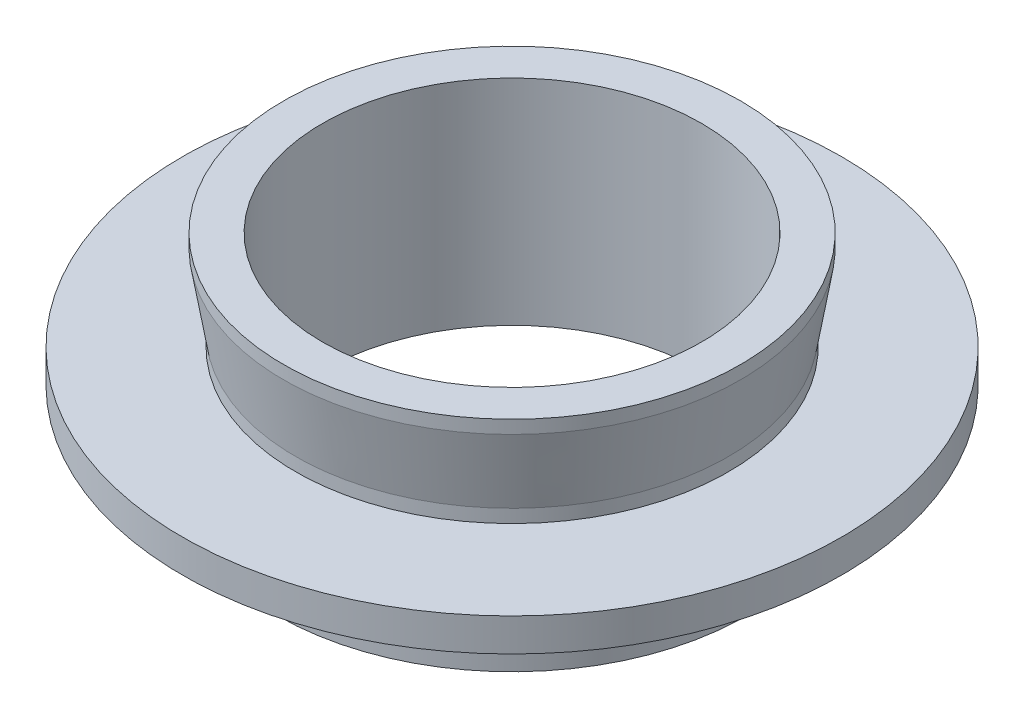
ISO-10303-21;
HEADER;
FILE_DESCRIPTION(('STEP AP214'),'2;1');
FILE_NAME('part.step','',(''),(''),'','','');
FILE_SCHEMA(('AUTOMOTIVE_DESIGN { 1 0 10303 214 1 1 1 1 }'));
ENDSEC;
DATA;
#1=APPLICATION_CONTEXT('core data for automotive mechanical design processes');
#2=APPLICATION_PROTOCOL_DEFINITION('international standard','automotive_design',2000,#1);
#3=PRODUCT_CONTEXT('',#1,'mechanical');
#4=PRODUCT('Part','Part','',(#3));
#5=PRODUCT_RELATED_PRODUCT_CATEGORY('part','',(#4));
#6=PRODUCT_DEFINITION_FORMATION('','',#4);
#7=PRODUCT_DEFINITION_CONTEXT('part definition',#1,'design');
#8=PRODUCT_DEFINITION('design','',#6,#7);
#9=PRODUCT_DEFINITION_SHAPE('','',#8);
#10=(LENGTH_UNIT() NAMED_UNIT(*) SI_UNIT(.MILLI.,.METRE.));
#11=(NAMED_UNIT(*) PLANE_ANGLE_UNIT() SI_UNIT($,.RADIAN.));
#12=(NAMED_UNIT(*) SI_UNIT($,.STERADIAN.) SOLID_ANGLE_UNIT());
#13=UNCERTAINTY_MEASURE_WITH_UNIT(LENGTH_MEASURE(1.E-05),#10,'distance_accuracy_value','');
#14=(GEOMETRIC_REPRESENTATION_CONTEXT(3) GLOBAL_UNCERTAINTY_ASSIGNED_CONTEXT((#13)) GLOBAL_UNIT_ASSIGNED_CONTEXT((#10,
#11,#12)) REPRESENTATION_CONTEXT('',''));
#15=CARTESIAN_POINT('',(0.,0.,0.));
#16=DIRECTION('',(0.,0.,1.));
#17=DIRECTION('',(1.,0.,0.));
#18=AXIS2_PLACEMENT_3D('',#15,#16,#17);
#19=CARTESIAN_POINT('',(-14.25,0.,0.));
#20=DIRECTION('',(0.,1.,0.));
#21=DIRECTION('',(0.,0.,1.));
#22=AXIS2_PLACEMENT_3D('',#19,#20,#21);
#23=PLANE('',#22);
#24=CARTESIAN_POINT('',(0.,0.,0.));
#25=DIRECTION('',(0.,-1.,0.));
#26=DIRECTION('',(0.,0.,-1.));
#27=AXIS2_PLACEMENT_3D('',#24,#25,#26);
#28=CIRCLE('',#27,11.5);
#29=CARTESIAN_POINT('',(0.,0.,-11.5));
#30=VERTEX_POINT('',#29);
#31=EDGE_CURVE('E10',#30,#30,#28,.T.);
#32=ORIENTED_EDGE('',*,*,#31,.F.);
#33=EDGE_LOOP('',(#32));
#34=FACE_BOUND('',#33,.T.);
#35=CARTESIAN_POINT('',(0.,0.,0.));
#36=DIRECTION('',(0.,-1.,0.));
#37=DIRECTION('',(0.,0.,-1.));
#38=AXIS2_PLACEMENT_3D('',#35,#36,#37);
#39=CIRCLE('',#38,14.25);
#40=CARTESIAN_POINT('',(0.,0.,-14.25));
#41=VERTEX_POINT('',#40);
#42=EDGE_CURVE('E77',#41,#41,#39,.T.);
#43=ORIENTED_EDGE('',*,*,#42,.T.);
#44=EDGE_LOOP('',(#43));
#45=FACE_BOUND('',#44,.T.);
#46=ADVANCED_FACE('F37',(#34,#45),#23,.F.);
#47=CARTESIAN_POINT('',(0.,0.,0.));
#48=DIRECTION('',(0.,-1.,0.));
#49=DIRECTION('',(0.,0.,-1.));
#50=AXIS2_PLACEMENT_3D('',#47,#48,#49);
#51=CYLINDRICAL_SURFACE('',#50,11.5);
#52=CARTESIAN_POINT('',(0.,13.,0.));
#53=DIRECTION('',(0.,-1.,0.));
#54=DIRECTION('',(0.,0.,-1.));
#55=AXIS2_PLACEMENT_3D('',#52,#53,#54);
#56=CIRCLE('',#55,11.5);
#57=CARTESIAN_POINT('',(0.,13.,-11.5));
#58=VERTEX_POINT('',#57);
#59=EDGE_CURVE('E43',#58,#58,#56,.T.);
#60=ORIENTED_EDGE('',*,*,#59,.F.);
#61=EDGE_LOOP('',(#60));
#62=FACE_BOUND('',#61,.T.);
#63=ORIENTED_EDGE('',*,*,#31,.T.);
#64=EDGE_LOOP('',(#63));
#65=FACE_BOUND('',#64,.T.);
#66=ADVANCED_FACE('F138',(#62,#65),#51,.F.);
#67=CARTESIAN_POINT('',(-11.5,13.,0.));
#68=DIRECTION('',(0.,-1.,0.));
#69=DIRECTION('',(0.,0.,-1.));
#70=AXIS2_PLACEMENT_3D('',#67,#68,#69);
#71=PLANE('',#70);
#72=CARTESIAN_POINT('',(0.,13.,0.));
#73=DIRECTION('',(0.,-1.,0.));
#74=DIRECTION('',(0.,0.,-1.));
#75=AXIS2_PLACEMENT_3D('',#72,#73,#74);
#76=CIRCLE('',#75,13.865);
#77=CARTESIAN_POINT('',(0.,13.,-13.865));
#78=VERTEX_POINT('',#77);
#79=EDGE_CURVE('E47',#78,#78,#76,.T.);
#80=ORIENTED_EDGE('',*,*,#79,.F.);
#81=EDGE_LOOP('',(#80));
#82=FACE_BOUND('',#81,.T.);
#83=ORIENTED_EDGE('',*,*,#59,.T.);
#84=EDGE_LOOP('',(#83));
#85=FACE_BOUND('',#84,.T.);
#86=ADVANCED_FACE('F133',(#82,#85),#71,.F.);
#87=CARTESIAN_POINT('',(0.,0.,0.));
#88=DIRECTION('',(0.,-1.,0.));
#89=DIRECTION('',(0.,0.,-1.));
#90=AXIS2_PLACEMENT_3D('',#87,#88,#89);
#91=CYLINDRICAL_SURFACE('',#90,13.865);
#92=CARTESIAN_POINT('',(0.,12.2,0.));
#93=DIRECTION('',(0.,-1.,0.));
#94=DIRECTION('',(0.,0.,-1.));
#95=AXIS2_PLACEMENT_3D('',#92,#93,#94);
#96=CIRCLE('',#95,13.865);
#97=CARTESIAN_POINT('',(0.,12.2,-13.865));
#98=VERTEX_POINT('',#97);
#99=EDGE_CURVE('E51',#98,#98,#96,.T.);
#100=ORIENTED_EDGE('',*,*,#99,.F.);
#101=EDGE_LOOP('',(#100));
#102=FACE_BOUND('',#101,.T.);
#103=ORIENTED_EDGE('',*,*,#79,.T.);
#104=EDGE_LOOP('',(#103));
#105=FACE_BOUND('',#104,.T.);
#106=ADVANCED_FACE('F127',(#102,#105),#91,.T.);
#107=CARTESIAN_POINT('',(0.,12.2,0.));
#108=DIRECTION('',(0.,1.,0.));
#109=DIRECTION('',(0.,0.,1.));
#110=AXIS2_PLACEMENT_3D('',#107,#108,#109);
#111=CONICAL_SURFACE('',#110,13.865,0.164411486247026);
#112=CARTESIAN_POINT('',(0.,7.8,0.));
#113=DIRECTION('',(0.,-1.,0.));
#114=DIRECTION('',(0.,0.,-1.));
#115=AXIS2_PLACEMENT_3D('',#112,#113,#114);
#116=CIRCLE('',#115,13.135);
#117=CARTESIAN_POINT('',(0.,7.8,-13.135));
#118=VERTEX_POINT('',#117);
#119=EDGE_CURVE('E56',#118,#118,#116,.T.);
#120=ORIENTED_EDGE('',*,*,#119,.F.);
#121=EDGE_LOOP('',(#120));
#122=FACE_BOUND('',#121,.T.);
#123=ORIENTED_EDGE('',*,*,#99,.T.);
#124=EDGE_LOOP('',(#123));
#125=FACE_BOUND('',#124,.T.);
#126=ADVANCED_FACE('F121',(#122,#125),#111,.T.);
#127=CARTESIAN_POINT('',(0.,0.,0.));
#128=DIRECTION('',(0.,-1.,0.));
#129=DIRECTION('',(0.,0.,-1.));
#130=AXIS2_PLACEMENT_3D('',#127,#128,#129);
#131=CYLINDRICAL_SURFACE('',#130,13.135);
#132=CARTESIAN_POINT('',(0.,7.,0.));
#133=DIRECTION('',(0.,-1.,0.));
#134=DIRECTION('',(0.,0.,-1.));
#135=AXIS2_PLACEMENT_3D('',#132,#133,#134);
#136=CIRCLE('',#135,13.135);
#137=CARTESIAN_POINT('',(0.,7.,-13.135));
#138=VERTEX_POINT('',#137);
#139=EDGE_CURVE('E59',#138,#138,#136,.T.);
#140=ORIENTED_EDGE('',*,*,#139,.F.);
#141=EDGE_LOOP('',(#140));
#142=FACE_BOUND('',#141,.T.);
#143=ORIENTED_EDGE('',*,*,#119,.T.);
#144=EDGE_LOOP('',(#143));
#145=FACE_BOUND('',#144,.T.);
#146=ADVANCED_FACE('F115',(#142,#145),#131,.T.);
#147=CARTESIAN_POINT('',(-13.135,7.,0.));
#148=DIRECTION('',(0.,-1.,0.));
#149=DIRECTION('',(0.,0.,-1.));
#150=AXIS2_PLACEMENT_3D('',#147,#148,#149);
#151=PLANE('',#150);
#152=CARTESIAN_POINT('',(0.,7.,0.));
#153=DIRECTION('',(0.,-1.,0.));
#154=DIRECTION('',(0.,0.,-1.));
#155=AXIS2_PLACEMENT_3D('',#152,#153,#154);
#156=CIRCLE('',#155,20.);
#157=CARTESIAN_POINT('',(0.,7.,-20.));
#158=VERTEX_POINT('',#157);
#159=EDGE_CURVE('E62',#158,#158,#156,.T.);
#160=ORIENTED_EDGE('',*,*,#159,.F.);
#161=EDGE_LOOP('',(#160));
#162=FACE_BOUND('',#161,.T.);
#163=ORIENTED_EDGE('',*,*,#139,.T.);
#164=EDGE_LOOP('',(#163));
#165=FACE_BOUND('',#164,.T.);
#166=ADVANCED_FACE('F109',(#162,#165),#151,.F.);
#167=CARTESIAN_POINT('',(0.,0.,0.));
#168=DIRECTION('',(0.,-1.,0.));
#169=DIRECTION('',(0.,0.,-1.));
#170=AXIS2_PLACEMENT_3D('',#167,#168,#169);
#171=CYLINDRICAL_SURFACE('',#170,20.);
#172=CARTESIAN_POINT('',(0.,5.,0.));
#173=DIRECTION('',(0.,-1.,0.));
#174=DIRECTION('',(0.,0.,-1.));
#175=AXIS2_PLACEMENT_3D('',#172,#173,#174);
#176=CIRCLE('',#175,20.);
#177=CARTESIAN_POINT('',(0.,5.,-20.));
#178=VERTEX_POINT('',#177);
#179=EDGE_CURVE('E65',#178,#178,#176,.T.);
#180=ORIENTED_EDGE('',*,*,#179,.F.);
#181=EDGE_LOOP('',(#180));
#182=FACE_BOUND('',#181,.T.);
#183=ORIENTED_EDGE('',*,*,#159,.T.);
#184=EDGE_LOOP('',(#183));
#185=FACE_BOUND('',#184,.T.);
#186=ADVANCED_FACE('F103',(#182,#185),#171,.T.);
#187=CARTESIAN_POINT('',(-20.,5.,0.));
#188=DIRECTION('',(0.,1.,0.));
#189=DIRECTION('',(0.,0.,1.));
#190=AXIS2_PLACEMENT_3D('',#187,#188,#189);
#191=PLANE('',#190);
#192=CARTESIAN_POINT('',(0.,5.,0.));
#193=DIRECTION('',(0.,-1.,0.));
#194=DIRECTION('',(0.,0.,-1.));
#195=AXIS2_PLACEMENT_3D('',#192,#193,#194);
#196=CIRCLE('',#195,14.);
#197=CARTESIAN_POINT('',(0.,5.,-14.));
#198=VERTEX_POINT('',#197);
#199=EDGE_CURVE('E68',#198,#198,#196,.T.);
#200=ORIENTED_EDGE('',*,*,#199,.F.);
#201=EDGE_LOOP('',(#200));
#202=FACE_BOUND('',#201,.T.);
#203=ORIENTED_EDGE('',*,*,#179,.T.);
#204=EDGE_LOOP('',(#203));
#205=FACE_BOUND('',#204,.T.);
#206=ADVANCED_FACE('F97',(#202,#205),#191,.F.);
#207=CARTESIAN_POINT('',(0.,0.,0.));
#208=DIRECTION('',(0.,-1.,0.));
#209=DIRECTION('',(0.,0.,-1.));
#210=AXIS2_PLACEMENT_3D('',#207,#208,#209);
#211=CYLINDRICAL_SURFACE('',#210,14.);
#212=CARTESIAN_POINT('',(0.,4.,0.));
#213=DIRECTION('',(0.,-1.,0.));
#214=DIRECTION('',(0.,0.,-1.));
#215=AXIS2_PLACEMENT_3D('',#212,#213,#214);
#216=CIRCLE('',#215,14.);
#217=CARTESIAN_POINT('',(0.,4.,-14.));
#218=VERTEX_POINT('',#217);
#219=EDGE_CURVE('E71',#218,#218,#216,.T.);
#220=ORIENTED_EDGE('',*,*,#219,.F.);
#221=EDGE_LOOP('',(#220));
#222=FACE_BOUND('',#221,.T.);
#223=ORIENTED_EDGE('',*,*,#199,.T.);
#224=EDGE_LOOP('',(#223));
#225=FACE_BOUND('',#224,.T.);
#226=ADVANCED_FACE('F91',(#222,#225),#211,.T.);
#227=CARTESIAN_POINT('',(-14.,4.,0.));
#228=DIRECTION('',(0.,-1.,0.));
#229=DIRECTION('',(0.,0.,-1.));
#230=AXIS2_PLACEMENT_3D('',#227,#228,#229);
#231=PLANE('',#230);
#232=CARTESIAN_POINT('',(0.,4.,0.));
#233=DIRECTION('',(0.,-1.,0.));
#234=DIRECTION('',(0.,0.,-1.));
#235=AXIS2_PLACEMENT_3D('',#232,#233,#234);
#236=CIRCLE('',#235,14.25);
#237=CARTESIAN_POINT('',(0.,4.,-14.25));
#238=VERTEX_POINT('',#237);
#239=EDGE_CURVE('E74',#238,#238,#236,.T.);
#240=ORIENTED_EDGE('',*,*,#239,.F.);
#241=EDGE_LOOP('',(#240));
#242=FACE_BOUND('',#241,.T.);
#243=ORIENTED_EDGE('',*,*,#219,.T.);
#244=EDGE_LOOP('',(#243));
#245=FACE_BOUND('',#244,.T.);
#246=ADVANCED_FACE('F85',(#242,#245),#231,.F.);
#247=CARTESIAN_POINT('',(0.,0.,0.));
#248=DIRECTION('',(0.,-1.,0.));
#249=DIRECTION('',(0.,0.,-1.));
#250=AXIS2_PLACEMENT_3D('',#247,#248,#249);
#251=CYLINDRICAL_SURFACE('',#250,14.25);
#252=ORIENTED_EDGE('',*,*,#42,.F.);
#253=EDGE_LOOP('',(#252));
#254=FACE_BOUND('',#253,.T.);
#255=ORIENTED_EDGE('',*,*,#239,.T.);
#256=EDGE_LOOP('',(#255));
#257=FACE_BOUND('',#256,.T.);
#258=ADVANCED_FACE('F82',(#254,#257),#251,.T.);
#259=CLOSED_SHELL('',(#46,#66,#86,#106,#126,#146,#166,#186,#206,#226,#246,#258));
#260=MANIFOLD_SOLID_BREP('B2',#259);
#261=ADVANCED_BREP_SHAPE_REPRESENTATION('',(#18,#260),#14);
#262=SHAPE_DEFINITION_REPRESENTATION(#9,#261);
ENDSEC;
END-ISO-10303-21;
